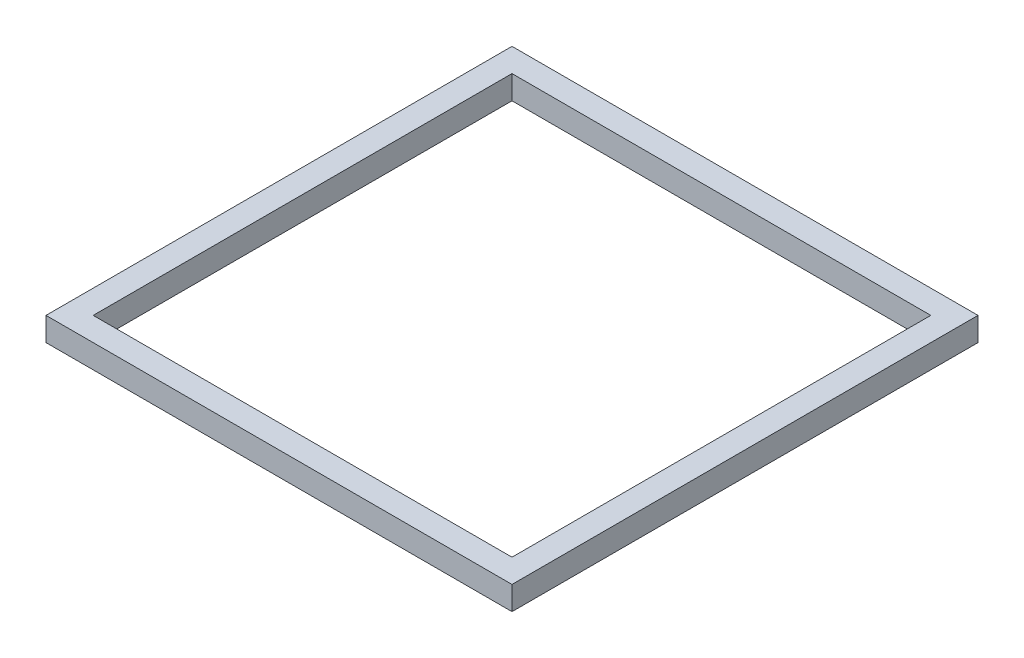
ISO-10303-21;
HEADER;
FILE_DESCRIPTION(('STEP AP214'),'2;1');
FILE_NAME('part.step','',(''),(''),'','','');
FILE_SCHEMA(('AUTOMOTIVE_DESIGN { 1 0 10303 214 1 1 1 1 }'));
ENDSEC;
DATA;
#1=APPLICATION_CONTEXT('core data for automotive mechanical design processes');
#2=APPLICATION_PROTOCOL_DEFINITION('international standard','automotive_design',2000,#1);
#3=PRODUCT_CONTEXT('',#1,'mechanical');
#4=PRODUCT('Part','Part','',(#3));
#5=PRODUCT_RELATED_PRODUCT_CATEGORY('part','',(#4));
#6=PRODUCT_DEFINITION_FORMATION('','',#4);
#7=PRODUCT_DEFINITION_CONTEXT('part definition',#1,'design');
#8=PRODUCT_DEFINITION('design','',#6,#7);
#9=PRODUCT_DEFINITION_SHAPE('','',#8);
#10=(LENGTH_UNIT() NAMED_UNIT(*) SI_UNIT(.MILLI.,.METRE.));
#11=(NAMED_UNIT(*) PLANE_ANGLE_UNIT() SI_UNIT($,.RADIAN.));
#12=(NAMED_UNIT(*) SI_UNIT($,.STERADIAN.) SOLID_ANGLE_UNIT());
#13=UNCERTAINTY_MEASURE_WITH_UNIT(LENGTH_MEASURE(1.E-05),#10,'distance_accuracy_value','');
#14=(GEOMETRIC_REPRESENTATION_CONTEXT(3) GLOBAL_UNCERTAINTY_ASSIGNED_CONTEXT((#13)) GLOBAL_UNIT_ASSIGNED_CONTEXT((#10,
#11,#12)) REPRESENTATION_CONTEXT('',''));
#15=CARTESIAN_POINT('',(0.,0.,0.));
#16=DIRECTION('',(0.,0.,1.));
#17=DIRECTION('',(1.,0.,0.));
#18=AXIS2_PLACEMENT_3D('',#15,#16,#17);
#19=CARTESIAN_POINT('',(62.7,6.35,62.7));
#20=DIRECTION('',(-1.,0.,0.));
#21=DIRECTION('',(0.,0.,1.));
#22=AXIS2_PLACEMENT_3D('',#19,#20,#21);
#23=PLANE('',#22);
#24=DIRECTION('',(0.,0.,-1.));
#25=VECTOR('',#24,1.);
#26=CARTESIAN_POINT('',(62.7,0.,62.7));
#27=LINE('',#26,#25);
#28=CARTESIAN_POINT('',(62.7,0.,62.7));
#29=VERTEX_POINT('',#28);
#30=CARTESIAN_POINT('',(62.7,0.,-62.7));
#31=VERTEX_POINT('',#30);
#32=EDGE_CURVE('E130',#29,#31,#27,.T.);
#33=ORIENTED_EDGE('',*,*,#32,.T.);
#34=DIRECTION('',(0.,-1.,0.));
#35=VECTOR('',#34,1.);
#36=CARTESIAN_POINT('',(62.7,6.35,-62.7));
#37=LINE('',#36,#35);
#38=CARTESIAN_POINT('',(62.7,6.35,-62.7));
#39=VERTEX_POINT('',#38);
#40=EDGE_CURVE('E11',#39,#31,#37,.T.);
#41=ORIENTED_EDGE('',*,*,#40,.F.);
#42=DIRECTION('',(0.,0.,-1.));
#43=VECTOR('',#42,1.);
#44=CARTESIAN_POINT('',(62.7,6.35,62.7));
#45=LINE('',#44,#43);
#46=CARTESIAN_POINT('',(62.7,6.35,62.7));
#47=VERTEX_POINT('',#46);
#48=EDGE_CURVE('E134',#47,#39,#45,.T.);
#49=ORIENTED_EDGE('',*,*,#48,.F.);
#50=DIRECTION('',(0.,-1.,0.));
#51=VECTOR('',#50,1.);
#52=CARTESIAN_POINT('',(62.7,6.35,62.7));
#53=LINE('',#52,#51);
#54=EDGE_CURVE('E144',#47,#29,#53,.T.);
#55=ORIENTED_EDGE('',*,*,#54,.T.);
#56=EDGE_LOOP('',(#33,#41,#49,#55));
#57=FACE_BOUND('',#56,.T.);
#58=ADVANCED_FACE('F33',(#57),#23,.F.);
#59=CARTESIAN_POINT('',(-62.7,6.35,-62.7));
#60=DIRECTION('',(0.,0.,1.));
#61=DIRECTION('',(1.,0.,0.));
#62=AXIS2_PLACEMENT_3D('',#59,#60,#61);
#63=PLANE('',#62);
#64=DIRECTION('',(-1.,0.,0.));
#65=VECTOR('',#64,1.);
#66=CARTESIAN_POINT('',(-62.7,0.,-62.7));
#67=LINE('',#66,#65);
#68=CARTESIAN_POINT('',(-62.7,0.,-62.7));
#69=VERTEX_POINT('',#68);
#70=EDGE_CURVE('E147',#31,#69,#67,.T.);
#71=ORIENTED_EDGE('',*,*,#70,.T.);
#72=DIRECTION('',(0.,-1.,0.));
#73=VECTOR('',#72,1.);
#74=CARTESIAN_POINT('',(-62.7,6.35,-62.7));
#75=LINE('',#74,#73);
#76=CARTESIAN_POINT('',(-62.7,6.35,-62.7));
#77=VERTEX_POINT('',#76);
#78=EDGE_CURVE('E40',#77,#69,#75,.T.);
#79=ORIENTED_EDGE('',*,*,#78,.F.);
#80=DIRECTION('',(-1.,0.,0.));
#81=VECTOR('',#80,1.);
#82=CARTESIAN_POINT('',(-62.7,6.35,-62.7));
#83=LINE('',#82,#81);
#84=EDGE_CURVE('E137',#39,#77,#83,.T.);
#85=ORIENTED_EDGE('',*,*,#84,.F.);
#86=ORIENTED_EDGE('',*,*,#40,.T.);
#87=EDGE_LOOP('',(#71,#79,#85,#86));
#88=FACE_BOUND('',#87,.T.);
#89=ADVANCED_FACE('F175',(#88),#63,.F.);
#90=CARTESIAN_POINT('',(-62.7,6.35,62.7));
#91=DIRECTION('',(1.,0.,0.));
#92=DIRECTION('',(0.,0.,-1.));
#93=AXIS2_PLACEMENT_3D('',#90,#91,#92);
#94=PLANE('',#93);
#95=DIRECTION('',(0.,0.,1.));
#96=VECTOR('',#95,1.);
#97=CARTESIAN_POINT('',(-62.7,0.,62.7));
#98=LINE('',#97,#96);
#99=CARTESIAN_POINT('',(-62.7,0.,62.7));
#100=VERTEX_POINT('',#99);
#101=EDGE_CURVE('E149',#69,#100,#98,.T.);
#102=ORIENTED_EDGE('',*,*,#101,.T.);
#103=DIRECTION('',(0.,-1.,0.));
#104=VECTOR('',#103,1.);
#105=CARTESIAN_POINT('',(-62.7,6.35,62.7));
#106=LINE('',#105,#104);
#107=CARTESIAN_POINT('',(-62.7,6.35,62.7));
#108=VERTEX_POINT('',#107);
#109=EDGE_CURVE('E154',#108,#100,#106,.T.);
#110=ORIENTED_EDGE('',*,*,#109,.F.);
#111=DIRECTION('',(0.,0.,1.));
#112=VECTOR('',#111,1.);
#113=CARTESIAN_POINT('',(-62.7,6.35,62.7));
#114=LINE('',#113,#112);
#115=EDGE_CURVE('E140',#77,#108,#114,.T.);
#116=ORIENTED_EDGE('',*,*,#115,.F.);
#117=ORIENTED_EDGE('',*,*,#78,.T.);
#118=EDGE_LOOP('',(#102,#110,#116,#117));
#119=FACE_BOUND('',#118,.T.);
#120=ADVANCED_FACE('F161',(#119),#94,.F.);
#121=CARTESIAN_POINT('',(-62.7,6.35,62.7));
#122=DIRECTION('',(0.,0.,-1.));
#123=DIRECTION('',(-1.,0.,0.));
#124=AXIS2_PLACEMENT_3D('',#121,#122,#123);
#125=PLANE('',#124);
#126=DIRECTION('',(1.,0.,0.));
#127=VECTOR('',#126,1.);
#128=CARTESIAN_POINT('',(-62.7,0.,62.7));
#129=LINE('',#128,#127);
#130=EDGE_CURVE('E138',#100,#29,#129,.T.);
#131=ORIENTED_EDGE('',*,*,#130,.T.);
#132=ORIENTED_EDGE('',*,*,#54,.F.);
#133=DIRECTION('',(1.,0.,0.));
#134=VECTOR('',#133,1.);
#135=CARTESIAN_POINT('',(-62.7,6.35,62.7));
#136=LINE('',#135,#134);
#137=EDGE_CURVE('E142',#108,#47,#136,.T.);
#138=ORIENTED_EDGE('',*,*,#137,.F.);
#139=ORIENTED_EDGE('',*,*,#109,.T.);
#140=EDGE_LOOP('',(#131,#132,#138,#139));
#141=FACE_BOUND('',#140,.T.);
#142=ADVANCED_FACE('F168',(#141),#125,.F.);
#143=CARTESIAN_POINT('',(0.,6.35,0.));
#144=DIRECTION('',(0.,-1.,0.));
#145=DIRECTION('',(0.,0.,-1.));
#146=AXIS2_PLACEMENT_3D('',#143,#144,#145);
#147=PLANE('',#146);
#148=DIRECTION('',(-1.,0.,0.));
#149=VECTOR('',#148,1.);
#150=CARTESIAN_POINT('',(-56.35,6.35,-56.35));
#151=LINE('',#150,#149);
#152=CARTESIAN_POINT('',(56.35,6.35,-56.35));
#153=VERTEX_POINT('',#152);
#154=CARTESIAN_POINT('',(-56.35,6.35,-56.35));
#155=VERTEX_POINT('',#154);
#156=EDGE_CURVE('E124',#153,#155,#151,.T.);
#157=ORIENTED_EDGE('',*,*,#156,.F.);
#158=DIRECTION('',(0.,0.,-1.));
#159=VECTOR('',#158,1.);
#160=CARTESIAN_POINT('',(56.35,6.35,56.35));
#161=LINE('',#160,#159);
#162=CARTESIAN_POINT('',(56.35,6.35,56.35));
#163=VERTEX_POINT('',#162);
#164=EDGE_CURVE('E47',#163,#153,#161,.T.);
#165=ORIENTED_EDGE('',*,*,#164,.F.);
#166=DIRECTION('',(1.,0.,0.));
#167=VECTOR('',#166,1.);
#168=CARTESIAN_POINT('',(-56.35,6.35,56.35));
#169=LINE('',#168,#167);
#170=CARTESIAN_POINT('',(-56.35,6.35,56.35));
#171=VERTEX_POINT('',#170);
#172=EDGE_CURVE('E115',#171,#163,#169,.T.);
#173=ORIENTED_EDGE('',*,*,#172,.F.);
#174=DIRECTION('',(0.,0.,1.));
#175=VECTOR('',#174,1.);
#176=CARTESIAN_POINT('',(-56.35,6.35,56.35));
#177=LINE('',#176,#175);
#178=EDGE_CURVE('E118',#155,#171,#177,.T.);
#179=ORIENTED_EDGE('',*,*,#178,.F.);
#180=EDGE_LOOP('',(#157,#165,#173,#179));
#181=FACE_BOUND('',#180,.T.);
#182=ORIENTED_EDGE('',*,*,#48,.T.);
#183=ORIENTED_EDGE('',*,*,#84,.T.);
#184=ORIENTED_EDGE('',*,*,#115,.T.);
#185=ORIENTED_EDGE('',*,*,#137,.T.);
#186=EDGE_LOOP('',(#182,#183,#184,#185));
#187=FACE_BOUND('',#186,.T.);
#188=ADVANCED_FACE('F174',(#181,#187),#147,.F.);
#189=CARTESIAN_POINT('',(0.,0.,0.));
#190=DIRECTION('',(0.,-1.,0.));
#191=DIRECTION('',(0.,0.,-1.));
#192=AXIS2_PLACEMENT_3D('',#189,#190,#191);
#193=PLANE('',#192);
#194=DIRECTION('',(0.,0.,-1.));
#195=VECTOR('',#194,1.);
#196=CARTESIAN_POINT('',(56.35,0.,56.35));
#197=LINE('',#196,#195);
#198=CARTESIAN_POINT('',(56.35,0.,56.35));
#199=VERTEX_POINT('',#198);
#200=CARTESIAN_POINT('',(56.35,0.,-56.35));
#201=VERTEX_POINT('',#200);
#202=EDGE_CURVE('E99',#199,#201,#197,.T.);
#203=ORIENTED_EDGE('',*,*,#202,.T.);
#204=DIRECTION('',(-1.,0.,0.));
#205=VECTOR('',#204,1.);
#206=CARTESIAN_POINT('',(-56.35,0.,-56.35));
#207=LINE('',#206,#205);
#208=CARTESIAN_POINT('',(-56.35,0.,-56.35));
#209=VERTEX_POINT('',#208);
#210=EDGE_CURVE('E108',#201,#209,#207,.T.);
#211=ORIENTED_EDGE('',*,*,#210,.T.);
#212=DIRECTION('',(0.,0.,1.));
#213=VECTOR('',#212,1.);
#214=CARTESIAN_POINT('',(-56.35,0.,56.35));
#215=LINE('',#214,#213);
#216=CARTESIAN_POINT('',(-56.35,0.,56.35));
#217=VERTEX_POINT('',#216);
#218=EDGE_CURVE('E55',#209,#217,#215,.T.);
#219=ORIENTED_EDGE('',*,*,#218,.T.);
#220=DIRECTION('',(1.,0.,0.));
#221=VECTOR('',#220,1.);
#222=CARTESIAN_POINT('',(-56.35,0.,56.35));
#223=LINE('',#222,#221);
#224=EDGE_CURVE('E105',#217,#199,#223,.T.);
#225=ORIENTED_EDGE('',*,*,#224,.T.);
#226=EDGE_LOOP('',(#203,#211,#219,#225));
#227=FACE_BOUND('',#226,.T.);
#228=ORIENTED_EDGE('',*,*,#32,.F.);
#229=ORIENTED_EDGE('',*,*,#130,.F.);
#230=ORIENTED_EDGE('',*,*,#101,.F.);
#231=ORIENTED_EDGE('',*,*,#70,.F.);
#232=EDGE_LOOP('',(#228,#229,#230,#231));
#233=FACE_BOUND('',#232,.T.);
#234=ADVANCED_FACE('F112',(#227,#233),#193,.T.);
#235=CARTESIAN_POINT('',(56.35,0.,56.35));
#236=DIRECTION('',(1.,0.,0.));
#237=DIRECTION('',(0.,0.,-1.));
#238=AXIS2_PLACEMENT_3D('',#235,#236,#237);
#239=PLANE('',#238);
#240=ORIENTED_EDGE('',*,*,#164,.T.);
#241=DIRECTION('',(0.,1.,0.));
#242=VECTOR('',#241,1.);
#243=CARTESIAN_POINT('',(56.35,0.,-56.35));
#244=LINE('',#243,#242);
#245=EDGE_CURVE('E95',#201,#153,#244,.T.);
#246=ORIENTED_EDGE('',*,*,#245,.F.);
#247=ORIENTED_EDGE('',*,*,#202,.F.);
#248=DIRECTION('',(0.,1.,0.));
#249=VECTOR('',#248,1.);
#250=CARTESIAN_POINT('',(56.35,0.,56.35));
#251=LINE('',#250,#249);
#252=EDGE_CURVE('E128',#199,#163,#251,.T.);
#253=ORIENTED_EDGE('',*,*,#252,.T.);
#254=EDGE_LOOP('',(#240,#246,#247,#253));
#255=FACE_BOUND('',#254,.T.);
#256=ADVANCED_FACE('F97',(#255),#239,.F.);
#257=CARTESIAN_POINT('',(-56.35,0.,56.35));
#258=DIRECTION('',(0.,0.,1.));
#259=DIRECTION('',(1.,0.,0.));
#260=AXIS2_PLACEMENT_3D('',#257,#258,#259);
#261=PLANE('',#260);
#262=ORIENTED_EDGE('',*,*,#172,.T.);
#263=ORIENTED_EDGE('',*,*,#252,.F.);
#264=ORIENTED_EDGE('',*,*,#224,.F.);
#265=DIRECTION('',(0.,1.,0.));
#266=VECTOR('',#265,1.);
#267=CARTESIAN_POINT('',(-56.35,0.,56.35));
#268=LINE('',#267,#266);
#269=EDGE_CURVE('E131',#217,#171,#268,.T.);
#270=ORIENTED_EDGE('',*,*,#269,.T.);
#271=EDGE_LOOP('',(#262,#263,#264,#270));
#272=FACE_BOUND('',#271,.T.);
#273=ADVANCED_FACE('F192',(#272),#261,.F.);
#274=CARTESIAN_POINT('',(-56.35,0.,56.35));
#275=DIRECTION('',(-1.,0.,0.));
#276=DIRECTION('',(0.,0.,1.));
#277=AXIS2_PLACEMENT_3D('',#274,#275,#276);
#278=PLANE('',#277);
#279=ORIENTED_EDGE('',*,*,#178,.T.);
#280=ORIENTED_EDGE('',*,*,#269,.F.);
#281=ORIENTED_EDGE('',*,*,#218,.F.);
#282=DIRECTION('',(0.,1.,0.));
#283=VECTOR('',#282,1.);
#284=CARTESIAN_POINT('',(-56.35,0.,-56.35));
#285=LINE('',#284,#283);
#286=EDGE_CURVE('E104',#209,#155,#285,.T.);
#287=ORIENTED_EDGE('',*,*,#286,.T.);
#288=EDGE_LOOP('',(#279,#280,#281,#287));
#289=FACE_BOUND('',#288,.T.);
#290=ADVANCED_FACE('F195',(#289),#278,.F.);
#291=CARTESIAN_POINT('',(-56.35,0.,-56.35));
#292=DIRECTION('',(0.,0.,-1.));
#293=DIRECTION('',(-1.,0.,0.));
#294=AXIS2_PLACEMENT_3D('',#291,#292,#293);
#295=PLANE('',#294);
#296=ORIENTED_EDGE('',*,*,#156,.T.);
#297=ORIENTED_EDGE('',*,*,#286,.F.);
#298=ORIENTED_EDGE('',*,*,#210,.F.);
#299=ORIENTED_EDGE('',*,*,#245,.T.);
#300=EDGE_LOOP('',(#296,#297,#298,#299));
#301=FACE_BOUND('',#300,.T.);
#302=ADVANCED_FACE('F109',(#301),#295,.F.);
#303=CLOSED_SHELL('',(#58,#89,#120,#142,#188,#234,#256,#273,#290,#302));
#304=MANIFOLD_SOLID_BREP('B2',#303);
#305=ADVANCED_BREP_SHAPE_REPRESENTATION('',(#18,#304),#14);
#306=SHAPE_DEFINITION_REPRESENTATION(#9,#305);
ENDSEC;
END-ISO-10303-21;
